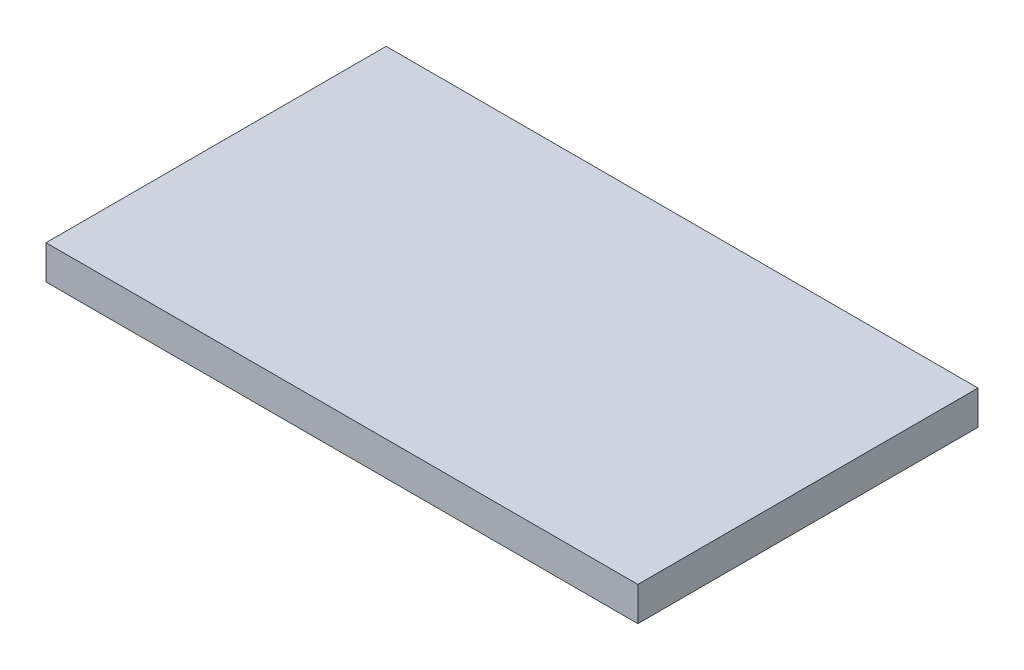
ISO-10303-21;
HEADER;
FILE_DESCRIPTION(('STEP AP214'),'2;1');
FILE_NAME('part.step','',(''),(''),'','','');
FILE_SCHEMA(('AUTOMOTIVE_DESIGN { 1 0 10303 214 1 1 1 1 }'));
ENDSEC;
DATA;
#1=APPLICATION_CONTEXT('core data for automotive mechanical design processes');
#2=APPLICATION_PROTOCOL_DEFINITION('international standard','automotive_design',2000,#1);
#3=PRODUCT_CONTEXT('',#1,'mechanical');
#4=PRODUCT('Part','Part','',(#3));
#5=PRODUCT_RELATED_PRODUCT_CATEGORY('part','',(#4));
#6=PRODUCT_DEFINITION_FORMATION('','',#4);
#7=PRODUCT_DEFINITION_CONTEXT('part definition',#1,'design');
#8=PRODUCT_DEFINITION('design','',#6,#7);
#9=PRODUCT_DEFINITION_SHAPE('','',#8);
#10=(LENGTH_UNIT() NAMED_UNIT(*) SI_UNIT(.MILLI.,.METRE.));
#11=(NAMED_UNIT(*) PLANE_ANGLE_UNIT() SI_UNIT($,.RADIAN.));
#12=(NAMED_UNIT(*) SI_UNIT($,.STERADIAN.) SOLID_ANGLE_UNIT());
#13=UNCERTAINTY_MEASURE_WITH_UNIT(LENGTH_MEASURE(1.E-05),#10,'distance_accuracy_value','');
#14=(GEOMETRIC_REPRESENTATION_CONTEXT(3) GLOBAL_UNCERTAINTY_ASSIGNED_CONTEXT((#13)) GLOBAL_UNIT_ASSIGNED_CONTEXT((#10,
#11,#12)) REPRESENTATION_CONTEXT('',''));
#15=CARTESIAN_POINT('',(0.,0.,0.));
#16=DIRECTION('',(0.,0.,1.));
#17=DIRECTION('',(1.,0.,0.));
#18=AXIS2_PLACEMENT_3D('',#15,#16,#17);
#19=CARTESIAN_POINT('',(43.5000000000001,5.,-25.0000000000004));
#20=DIRECTION('',(-1.,0.,0.));
#21=DIRECTION('',(0.,0.,1.));
#22=AXIS2_PLACEMENT_3D('',#19,#20,#21);
#23=PLANE('',#22);
#24=DIRECTION('',(0.,0.,-1.));
#25=VECTOR('',#24,1.);
#26=CARTESIAN_POINT('',(43.5000000000001,0.,-25.0000000000004));
#27=LINE('',#26,#25);
#28=CARTESIAN_POINT('',(43.5000000000003,0.,24.9999999999996));
#29=VERTEX_POINT('',#28);
#30=CARTESIAN_POINT('',(43.5000000000001,0.,-25.0000000000004));
#31=VERTEX_POINT('',#30);
#32=EDGE_CURVE('E95',#29,#31,#27,.T.);
#33=ORIENTED_EDGE('',*,*,#32,.T.);
#34=DIRECTION('',(0.,-1.,0.));
#35=VECTOR('',#34,1.);
#36=CARTESIAN_POINT('',(43.5000000000001,5.,-25.0000000000004));
#37=LINE('',#36,#35);
#38=CARTESIAN_POINT('',(43.5000000000001,5.,-25.0000000000004));
#39=VERTEX_POINT('',#38);
#40=EDGE_CURVE('E11',#39,#31,#37,.T.);
#41=ORIENTED_EDGE('',*,*,#40,.F.);
#42=DIRECTION('',(0.,0.,-1.));
#43=VECTOR('',#42,1.);
#44=CARTESIAN_POINT('',(43.5000000000001,5.,-25.0000000000004));
#45=LINE('',#44,#43);
#46=CARTESIAN_POINT('',(43.5000000000003,5.,24.9999999999996));
#47=VERTEX_POINT('',#46);
#48=EDGE_CURVE('E83',#47,#39,#45,.T.);
#49=ORIENTED_EDGE('',*,*,#48,.F.);
#50=DIRECTION('',(0.,-1.,0.));
#51=VECTOR('',#50,1.);
#52=CARTESIAN_POINT('',(43.5000000000003,5.,24.9999999999996));
#53=LINE('',#52,#51);
#54=EDGE_CURVE('E91',#47,#29,#53,.T.);
#55=ORIENTED_EDGE('',*,*,#54,.T.);
#56=EDGE_LOOP('',(#33,#41,#49,#55));
#57=FACE_BOUND('',#56,.T.);
#58=ADVANCED_FACE('F32',(#57),#23,.F.);
#59=CARTESIAN_POINT('',(-43.5000000000001,5.,-25.0000000000004));
#60=DIRECTION('',(0.,0.,1.));
#61=DIRECTION('',(1.,0.,0.));
#62=AXIS2_PLACEMENT_3D('',#59,#60,#61);
#63=PLANE('',#62);
#64=DIRECTION('',(-1.,0.,0.));
#65=VECTOR('',#64,1.);
#66=CARTESIAN_POINT('',(-43.5000000000001,0.,-25.0000000000004));
#67=LINE('',#66,#65);
#68=CARTESIAN_POINT('',(-43.5000000000001,0.,-25.0000000000004));
#69=VERTEX_POINT('',#68);
#70=EDGE_CURVE('E87',#31,#69,#67,.T.);
#71=ORIENTED_EDGE('',*,*,#70,.T.);
#72=DIRECTION('',(0.,-1.,0.));
#73=VECTOR('',#72,1.);
#74=CARTESIAN_POINT('',(-43.5000000000001,5.,-25.0000000000004));
#75=LINE('',#74,#73);
#76=CARTESIAN_POINT('',(-43.5000000000001,5.,-25.0000000000004));
#77=VERTEX_POINT('',#76);
#78=EDGE_CURVE('E40',#77,#69,#75,.T.);
#79=ORIENTED_EDGE('',*,*,#78,.F.);
#80=DIRECTION('',(-1.,0.,0.));
#81=VECTOR('',#80,1.);
#82=CARTESIAN_POINT('',(-43.5000000000001,5.,-25.0000000000004));
#83=LINE('',#82,#81);
#84=EDGE_CURVE('E78',#39,#77,#83,.T.);
#85=ORIENTED_EDGE('',*,*,#84,.F.);
#86=ORIENTED_EDGE('',*,*,#40,.T.);
#87=EDGE_LOOP('',(#71,#79,#85,#86));
#88=FACE_BOUND('',#87,.T.);
#89=ADVANCED_FACE('F86',(#88),#63,.F.);
#90=CARTESIAN_POINT('',(-43.5000000000001,5.,-25.0000000000004));
#91=DIRECTION('',(1.,0.,0.));
#92=DIRECTION('',(0.,0.,-1.));
#93=AXIS2_PLACEMENT_3D('',#90,#91,#92);
#94=PLANE('',#93);
#95=DIRECTION('',(0.,0.,1.));
#96=VECTOR('',#95,1.);
#97=CARTESIAN_POINT('',(-43.5000000000001,0.,-25.0000000000004));
#98=LINE('',#97,#96);
#99=CARTESIAN_POINT('',(-43.4999999999999,0.,24.9999999999996));
#100=VERTEX_POINT('',#99);
#101=EDGE_CURVE('E65',#69,#100,#98,.T.);
#102=ORIENTED_EDGE('',*,*,#101,.T.);
#103=DIRECTION('',(0.,-1.,0.));
#104=VECTOR('',#103,1.);
#105=CARTESIAN_POINT('',(-43.4999999999999,5.,24.9999999999996));
#106=LINE('',#105,#104);
#107=CARTESIAN_POINT('',(-43.4999999999999,5.,24.9999999999996));
#108=VERTEX_POINT('',#107);
#109=EDGE_CURVE('E88',#108,#100,#106,.T.);
#110=ORIENTED_EDGE('',*,*,#109,.F.);
#111=DIRECTION('',(0.,0.,1.));
#112=VECTOR('',#111,1.);
#113=CARTESIAN_POINT('',(-43.5000000000001,5.,-25.0000000000004));
#114=LINE('',#113,#112);
#115=EDGE_CURVE('E81',#77,#108,#114,.T.);
#116=ORIENTED_EDGE('',*,*,#115,.F.);
#117=ORIENTED_EDGE('',*,*,#78,.T.);
#118=EDGE_LOOP('',(#102,#110,#116,#117));
#119=FACE_BOUND('',#118,.T.);
#120=ADVANCED_FACE('F89',(#119),#94,.F.);
#121=CARTESIAN_POINT('',(-43.4999999999999,5.,24.9999999999996));
#122=DIRECTION('',(0.,0.,-1.));
#123=DIRECTION('',(-1.,0.,0.));
#124=AXIS2_PLACEMENT_3D('',#121,#122,#123);
#125=PLANE('',#124);
#126=DIRECTION('',(1.,0.,0.));
#127=VECTOR('',#126,1.);
#128=CARTESIAN_POINT('',(-43.4999999999999,0.,24.9999999999996));
#129=LINE('',#128,#127);
#130=EDGE_CURVE('E71',#100,#29,#129,.T.);
#131=ORIENTED_EDGE('',*,*,#130,.T.);
#132=ORIENTED_EDGE('',*,*,#54,.F.);
#133=DIRECTION('',(1.,0.,0.));
#134=VECTOR('',#133,1.);
#135=CARTESIAN_POINT('',(-43.4999999999999,5.,24.9999999999996));
#136=LINE('',#135,#134);
#137=EDGE_CURVE('E48',#108,#47,#136,.T.);
#138=ORIENTED_EDGE('',*,*,#137,.F.);
#139=ORIENTED_EDGE('',*,*,#109,.T.);
#140=EDGE_LOOP('',(#131,#132,#138,#139));
#141=FACE_BOUND('',#140,.T.);
#142=ADVANCED_FACE('F102',(#141),#125,.F.);
#143=CARTESIAN_POINT('',(0.,5.,0.));
#144=DIRECTION('',(0.,1.,0.));
#145=DIRECTION('',(0.,0.,1.));
#146=AXIS2_PLACEMENT_3D('',#143,#144,#145);
#147=PLANE('',#146);
#148=ORIENTED_EDGE('',*,*,#48,.T.);
#149=ORIENTED_EDGE('',*,*,#84,.T.);
#150=ORIENTED_EDGE('',*,*,#115,.T.);
#151=ORIENTED_EDGE('',*,*,#137,.T.);
#152=EDGE_LOOP('',(#148,#149,#150,#151));
#153=FACE_BOUND('',#152,.T.);
#154=ADVANCED_FACE('F79',(#153),#147,.T.);
#155=CARTESIAN_POINT('',(0.,0.,0.));
#156=DIRECTION('',(0.,1.,0.));
#157=DIRECTION('',(0.,0.,1.));
#158=AXIS2_PLACEMENT_3D('',#155,#156,#157);
#159=PLANE('',#158);
#160=ORIENTED_EDGE('',*,*,#32,.F.);
#161=ORIENTED_EDGE('',*,*,#130,.F.);
#162=ORIENTED_EDGE('',*,*,#101,.F.);
#163=ORIENTED_EDGE('',*,*,#70,.F.);
#164=EDGE_LOOP('',(#160,#161,#162,#163));
#165=FACE_BOUND('',#164,.T.);
#166=ADVANCED_FACE('F105',(#165),#159,.F.);
#167=CLOSED_SHELL('',(#58,#89,#120,#142,#154,#166));
#168=MANIFOLD_SOLID_BREP('B2',#167);
#169=ADVANCED_BREP_SHAPE_REPRESENTATION('',(#18,#168),#14);
#170=SHAPE_DEFINITION_REPRESENTATION(#9,#169);
ENDSEC;
END-ISO-10303-21;
